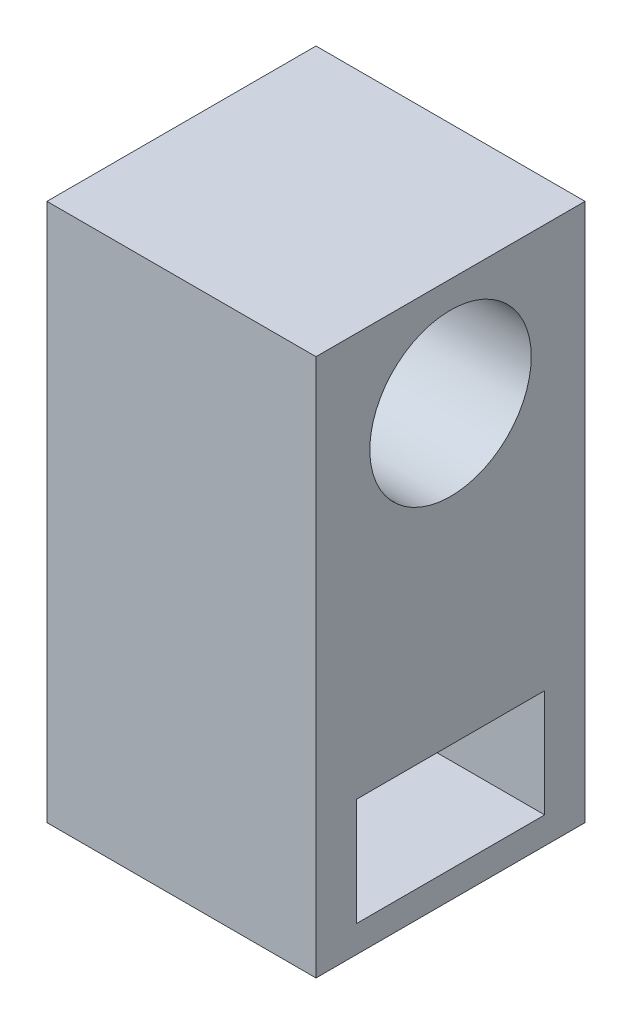
ISO-10303-21;
HEADER;
FILE_DESCRIPTION(('STEP AP214'),'2;1');
FILE_NAME('part.step','',(''),(''),'','','');
FILE_SCHEMA(('AUTOMOTIVE_DESIGN { 1 0 10303 214 1 1 1 1 }'));
ENDSEC;
DATA;
#1=APPLICATION_CONTEXT('core data for automotive mechanical design processes');
#2=APPLICATION_PROTOCOL_DEFINITION('international standard','automotive_design',2000,#1);
#3=PRODUCT_CONTEXT('',#1,'mechanical');
#4=PRODUCT('Part','Part','',(#3));
#5=PRODUCT_RELATED_PRODUCT_CATEGORY('part','',(#4));
#6=PRODUCT_DEFINITION_FORMATION('','',#4);
#7=PRODUCT_DEFINITION_CONTEXT('part definition',#1,'design');
#8=PRODUCT_DEFINITION('design','',#6,#7);
#9=PRODUCT_DEFINITION_SHAPE('','',#8);
#10=(LENGTH_UNIT() NAMED_UNIT(*) SI_UNIT(.MILLI.,.METRE.));
#11=(NAMED_UNIT(*) PLANE_ANGLE_UNIT() SI_UNIT($,.RADIAN.));
#12=(NAMED_UNIT(*) SI_UNIT($,.STERADIAN.) SOLID_ANGLE_UNIT());
#13=UNCERTAINTY_MEASURE_WITH_UNIT(LENGTH_MEASURE(1.E-05),#10,'distance_accuracy_value','');
#14=(GEOMETRIC_REPRESENTATION_CONTEXT(3) GLOBAL_UNCERTAINTY_ASSIGNED_CONTEXT((#13)) GLOBAL_UNIT_ASSIGNED_CONTEXT((#10,
#11,#12)) REPRESENTATION_CONTEXT('',''));
#15=CARTESIAN_POINT('',(0.,0.,0.));
#16=DIRECTION('',(0.,0.,1.));
#17=DIRECTION('',(1.,0.,0.));
#18=AXIS2_PLACEMENT_3D('',#15,#16,#17);
#19=CARTESIAN_POINT('',(41.2371134020619,70.1030927835051,100.));
#20=DIRECTION('',(0.,-1.,0.));
#21=DIRECTION('',(0.,0.,-1.));
#22=AXIS2_PLACEMENT_3D('',#19,#20,#21);
#23=PLANE('',#22);
#24=DIRECTION('',(-1.,0.,0.));
#25=VECTOR('',#24,1.);
#26=CARTESIAN_POINT('',(41.2371134020619,70.1030927835051,0.));
#27=LINE('',#26,#25);
#28=CARTESIAN_POINT('',(41.2371134020619,70.1030927835051,0.));
#29=VERTEX_POINT('',#28);
#30=CARTESIAN_POINT('',(-58.7628865979382,70.1030927835051,0.));
#31=VERTEX_POINT('',#30);
#32=EDGE_CURVE('E170',#29,#31,#27,.T.);
#33=ORIENTED_EDGE('',*,*,#32,.T.);
#34=DIRECTION('',(0.,0.,-1.));
#35=VECTOR('',#34,1.);
#36=CARTESIAN_POINT('',(-58.7628865979382,70.1030927835051,100.));
#37=LINE('',#36,#35);
#38=CARTESIAN_POINT('',(-58.7628865979382,70.1030927835051,100.));
#39=VERTEX_POINT('',#38);
#40=EDGE_CURVE('E11',#39,#31,#37,.T.);
#41=ORIENTED_EDGE('',*,*,#40,.F.);
#42=DIRECTION('',(-1.,0.,0.));
#43=VECTOR('',#42,1.);
#44=CARTESIAN_POINT('',(41.2371134020619,70.1030927835051,100.));
#45=LINE('',#44,#43);
#46=CARTESIAN_POINT('',(41.2371134020619,70.1030927835051,100.));
#47=VERTEX_POINT('',#46);
#48=EDGE_CURVE('E155',#47,#39,#45,.T.);
#49=ORIENTED_EDGE('',*,*,#48,.F.);
#50=DIRECTION('',(0.,0.,-1.));
#51=VECTOR('',#50,1.);
#52=CARTESIAN_POINT('',(41.2371134020619,70.1030927835051,100.));
#53=LINE('',#52,#51);
#54=EDGE_CURVE('E169',#47,#29,#53,.T.);
#55=ORIENTED_EDGE('',*,*,#54,.T.);
#56=EDGE_LOOP('',(#33,#41,#49,#55));
#57=FACE_BOUND('',#56,.T.);
#58=ADVANCED_FACE('F39',(#57),#23,.F.);
#59=CARTESIAN_POINT('',(-58.7628865979382,70.1030927835051,100.));
#60=DIRECTION('',(1.,0.,0.));
#61=DIRECTION('',(0.,1.,0.));
#62=AXIS2_PLACEMENT_3D('',#59,#60,#61);
#63=PLANE('',#62);
#64=CARTESIAN_POINT('',(-58.7628865979382,30.1030927835051,50.));
#65=DIRECTION('',(1.,0.,0.));
#66=DIRECTION('',(0.,0.,-1.));
#67=AXIS2_PLACEMENT_3D('',#64,#65,#66);
#68=CIRCLE('',#67,30.);
#69=CARTESIAN_POINT('',(-58.7628865979382,30.1030927835051,20.));
#70=VERTEX_POINT('',#69);
#71=EDGE_CURVE('E175',#70,#70,#68,.T.);
#72=ORIENTED_EDGE('',*,*,#71,.T.);
#73=EDGE_LOOP('',(#72));
#74=FACE_BOUND('',#73,.T.);
#75=DIRECTION('',(0.,1.,0.));
#76=VECTOR('',#75,1.);
#77=CARTESIAN_POINT('',(-58.7628865979382,-119.896907216495,15.));
#78=LINE('',#77,#76);
#79=CARTESIAN_POINT('',(-58.7628865979382,-119.896907216495,15.));
#80=VERTEX_POINT('',#79);
#81=CARTESIAN_POINT('',(-58.7628865979382,-79.8969072164949,15.));
#82=VERTEX_POINT('',#81);
#83=EDGE_CURVE('E113',#80,#82,#78,.T.);
#84=ORIENTED_EDGE('',*,*,#83,.T.);
#85=DIRECTION('',(0.,0.,1.));
#86=VECTOR('',#85,1.);
#87=CARTESIAN_POINT('',(-58.7628865979382,-79.8969072164949,15.));
#88=LINE('',#87,#86);
#89=CARTESIAN_POINT('',(-58.7628865979382,-79.8969072164949,85.));
#90=VERTEX_POINT('',#89);
#91=EDGE_CURVE('E106',#82,#90,#88,.T.);
#92=ORIENTED_EDGE('',*,*,#91,.T.);
#93=DIRECTION('',(0.,-1.,0.));
#94=VECTOR('',#93,1.);
#95=CARTESIAN_POINT('',(-58.7628865979382,-79.8969072164949,85.));
#96=LINE('',#95,#94);
#97=CARTESIAN_POINT('',(-58.7628865979381,-119.896907216495,85.));
#98=VERTEX_POINT('',#97);
#99=EDGE_CURVE('E116',#90,#98,#96,.T.);
#100=ORIENTED_EDGE('',*,*,#99,.T.);
#101=DIRECTION('',(0.,0.,-1.));
#102=VECTOR('',#101,1.);
#103=CARTESIAN_POINT('',(-58.7628865979382,-119.896907216495,85.));
#104=LINE('',#103,#102);
#105=EDGE_CURVE('E54',#98,#80,#104,.T.);
#106=ORIENTED_EDGE('',*,*,#105,.T.);
#107=EDGE_LOOP('',(#84,#92,#100,#106));
#108=FACE_BOUND('',#107,.T.);
#109=DIRECTION('',(0.,-1.,0.));
#110=VECTOR('',#109,1.);
#111=CARTESIAN_POINT('',(-58.7628865979382,70.1030927835051,0.));
#112=LINE('',#111,#110);
#113=CARTESIAN_POINT('',(-58.7628865979381,-129.896907216495,0.));
#114=VERTEX_POINT('',#113);
#115=EDGE_CURVE('E174',#31,#114,#112,.T.);
#116=ORIENTED_EDGE('',*,*,#115,.T.);
#117=DIRECTION('',(0.,0.,-1.));
#118=VECTOR('',#117,1.);
#119=CARTESIAN_POINT('',(-58.7628865979381,-129.896907216495,100.));
#120=LINE('',#119,#118);
#121=CARTESIAN_POINT('',(-58.7628865979381,-129.896907216495,100.));
#122=VERTEX_POINT('',#121);
#123=EDGE_CURVE('E47',#122,#114,#120,.T.);
#124=ORIENTED_EDGE('',*,*,#123,.F.);
#125=DIRECTION('',(0.,-1.,0.));
#126=VECTOR('',#125,1.);
#127=CARTESIAN_POINT('',(-58.7628865979382,70.1030927835051,100.));
#128=LINE('',#127,#126);
#129=EDGE_CURVE('E159',#39,#122,#128,.T.);
#130=ORIENTED_EDGE('',*,*,#129,.F.);
#131=ORIENTED_EDGE('',*,*,#40,.T.);
#132=EDGE_LOOP('',(#116,#124,#130,#131));
#133=FACE_BOUND('',#132,.T.);
#134=ADVANCED_FACE('F121',(#74,#108,#133),#63,.F.);
#135=CARTESIAN_POINT('',(-58.7628865979381,-129.896907216495,100.));
#136=DIRECTION('',(0.,1.,0.));
#137=DIRECTION('',(0.,0.,1.));
#138=AXIS2_PLACEMENT_3D('',#135,#136,#137);
#139=PLANE('',#138);
#140=DIRECTION('',(1.,0.,0.));
#141=VECTOR('',#140,1.);
#142=CARTESIAN_POINT('',(-58.7628865979381,-129.896907216495,0.));
#143=LINE('',#142,#141);
#144=CARTESIAN_POINT('',(41.2371134020619,-129.896907216495,0.));
#145=VERTEX_POINT('',#144);
#146=EDGE_CURVE('E178',#114,#145,#143,.T.);
#147=ORIENTED_EDGE('',*,*,#146,.T.);
#148=DIRECTION('',(0.,0.,-1.));
#149=VECTOR('',#148,1.);
#150=CARTESIAN_POINT('',(41.2371134020619,-129.896907216495,100.));
#151=LINE('',#150,#149);
#152=CARTESIAN_POINT('',(41.2371134020619,-129.896907216495,100.));
#153=VERTEX_POINT('',#152);
#154=EDGE_CURVE('E186',#153,#145,#151,.T.);
#155=ORIENTED_EDGE('',*,*,#154,.F.);
#156=DIRECTION('',(1.,0.,0.));
#157=VECTOR('',#156,1.);
#158=CARTESIAN_POINT('',(-58.7628865979381,-129.896907216495,100.));
#159=LINE('',#158,#157);
#160=EDGE_CURVE('E163',#122,#153,#159,.T.);
#161=ORIENTED_EDGE('',*,*,#160,.F.);
#162=ORIENTED_EDGE('',*,*,#123,.T.);
#163=EDGE_LOOP('',(#147,#155,#161,#162));
#164=FACE_BOUND('',#163,.T.);
#165=ADVANCED_FACE('F195',(#164),#139,.F.);
#166=CARTESIAN_POINT('',(41.2371134020619,-129.896907216495,100.));
#167=DIRECTION('',(-1.,0.,0.));
#168=DIRECTION('',(0.,0.,1.));
#169=AXIS2_PLACEMENT_3D('',#166,#167,#168);
#170=PLANE('',#169);
#171=CARTESIAN_POINT('',(41.2371134020619,30.1030927835051,50.));
#172=DIRECTION('',(1.,0.,0.));
#173=DIRECTION('',(0.,0.,-1.));
#174=AXIS2_PLACEMENT_3D('',#171,#172,#173);
#175=CIRCLE('',#174,30.);
#176=CARTESIAN_POINT('',(41.2371134020619,30.1030927835051,20.));
#177=VERTEX_POINT('',#176);
#178=EDGE_CURVE('E132',#177,#177,#175,.T.);
#179=ORIENTED_EDGE('',*,*,#178,.F.);
#180=EDGE_LOOP('',(#179));
#181=FACE_BOUND('',#180,.T.);
#182=DIRECTION('',(0.,-1.,0.));
#183=VECTOR('',#182,1.);
#184=CARTESIAN_POINT('',(41.2371134020619,-79.8969072164949,85.));
#185=LINE('',#184,#183);
#186=CARTESIAN_POINT('',(41.2371134020619,-79.8969072164949,85.));
#187=VERTEX_POINT('',#186);
#188=CARTESIAN_POINT('',(41.2371134020619,-119.896907216495,85.));
#189=VERTEX_POINT('',#188);
#190=EDGE_CURVE('E141',#187,#189,#185,.T.);
#191=ORIENTED_EDGE('',*,*,#190,.F.);
#192=DIRECTION('',(0.,0.,1.));
#193=VECTOR('',#192,1.);
#194=CARTESIAN_POINT('',(41.2371134020619,-79.8969072164949,15.));
#195=LINE('',#194,#193);
#196=CARTESIAN_POINT('',(41.2371134020619,-79.8969072164949,15.));
#197=VERTEX_POINT('',#196);
#198=EDGE_CURVE('E62',#197,#187,#195,.T.);
#199=ORIENTED_EDGE('',*,*,#198,.F.);
#200=DIRECTION('',(0.,1.,0.));
#201=VECTOR('',#200,1.);
#202=CARTESIAN_POINT('',(41.2371134020619,-119.896907216495,15.));
#203=LINE('',#202,#201);
#204=CARTESIAN_POINT('',(41.2371134020619,-119.896907216495,15.));
#205=VERTEX_POINT('',#204);
#206=EDGE_CURVE('E125',#205,#197,#203,.T.);
#207=ORIENTED_EDGE('',*,*,#206,.F.);
#208=DIRECTION('',(0.,0.,-1.));
#209=VECTOR('',#208,1.);
#210=CARTESIAN_POINT('',(41.2371134020619,-119.896907216495,85.));
#211=LINE('',#210,#209);
#212=EDGE_CURVE('E129',#189,#205,#211,.T.);
#213=ORIENTED_EDGE('',*,*,#212,.F.);
#214=EDGE_LOOP('',(#191,#199,#207,#213));
#215=FACE_BOUND('',#214,.T.);
#216=DIRECTION('',(0.,1.,0.));
#217=VECTOR('',#216,1.);
#218=CARTESIAN_POINT('',(41.2371134020619,-129.896907216495,0.));
#219=LINE('',#218,#217);
#220=EDGE_CURVE('E160',#145,#29,#219,.T.);
#221=ORIENTED_EDGE('',*,*,#220,.T.);
#222=ORIENTED_EDGE('',*,*,#54,.F.);
#223=DIRECTION('',(0.,1.,0.));
#224=VECTOR('',#223,1.);
#225=CARTESIAN_POINT('',(41.2371134020619,-129.896907216495,100.));
#226=LINE('',#225,#224);
#227=EDGE_CURVE('E166',#153,#47,#226,.T.);
#228=ORIENTED_EDGE('',*,*,#227,.F.);
#229=ORIENTED_EDGE('',*,*,#154,.T.);
#230=EDGE_LOOP('',(#221,#222,#228,#229));
#231=FACE_BOUND('',#230,.T.);
#232=ADVANCED_FACE('F203',(#181,#215,#231),#170,.F.);
#233=CARTESIAN_POINT('',(0.,0.,100.));
#234=DIRECTION('',(0.,0.,1.));
#235=DIRECTION('',(1.,0.,0.));
#236=AXIS2_PLACEMENT_3D('',#233,#234,#235);
#237=PLANE('',#236);
#238=ORIENTED_EDGE('',*,*,#48,.T.);
#239=ORIENTED_EDGE('',*,*,#129,.T.);
#240=ORIENTED_EDGE('',*,*,#160,.T.);
#241=ORIENTED_EDGE('',*,*,#227,.T.);
#242=EDGE_LOOP('',(#238,#239,#240,#241));
#243=FACE_BOUND('',#242,.T.);
#244=ADVANCED_FACE('F209',(#243),#237,.T.);
#245=CARTESIAN_POINT('',(0.,0.,0.));
#246=DIRECTION('',(0.,0.,1.));
#247=DIRECTION('',(1.,0.,0.));
#248=AXIS2_PLACEMENT_3D('',#245,#246,#247);
#249=PLANE('',#248);
#250=ORIENTED_EDGE('',*,*,#32,.F.);
#251=ORIENTED_EDGE('',*,*,#220,.F.);
#252=ORIENTED_EDGE('',*,*,#146,.F.);
#253=ORIENTED_EDGE('',*,*,#115,.F.);
#254=EDGE_LOOP('',(#250,#251,#252,#253));
#255=FACE_BOUND('',#254,.T.);
#256=ADVANCED_FACE('F200',(#255),#249,.F.);
#257=CARTESIAN_POINT('',(-58.7628865979382,-79.8969072164949,15.));
#258=DIRECTION('',(0.,1.,0.));
#259=DIRECTION('',(0.,0.,1.));
#260=AXIS2_PLACEMENT_3D('',#257,#258,#259);
#261=PLANE('',#260);
#262=ORIENTED_EDGE('',*,*,#198,.T.);
#263=DIRECTION('',(1.,0.,0.));
#264=VECTOR('',#263,1.);
#265=CARTESIAN_POINT('',(-58.7628865979382,-79.8969072164949,85.));
#266=LINE('',#265,#264);
#267=EDGE_CURVE('E102',#90,#187,#266,.T.);
#268=ORIENTED_EDGE('',*,*,#267,.F.);
#269=ORIENTED_EDGE('',*,*,#91,.F.);
#270=DIRECTION('',(1.,0.,0.));
#271=VECTOR('',#270,1.);
#272=CARTESIAN_POINT('',(-58.7628865979382,-79.8969072164949,15.));
#273=LINE('',#272,#271);
#274=EDGE_CURVE('E147',#82,#197,#273,.T.);
#275=ORIENTED_EDGE('',*,*,#274,.T.);
#276=EDGE_LOOP('',(#262,#268,#269,#275));
#277=FACE_BOUND('',#276,.T.);
#278=ADVANCED_FACE('F104',(#277),#261,.F.);
#279=CARTESIAN_POINT('',(-58.7628865979382,-119.896907216495,15.));
#280=DIRECTION('',(0.,0.,-1.));
#281=DIRECTION('',(-1.,0.,0.));
#282=AXIS2_PLACEMENT_3D('',#279,#280,#281);
#283=PLANE('',#282);
#284=ORIENTED_EDGE('',*,*,#206,.T.);
#285=ORIENTED_EDGE('',*,*,#274,.F.);
#286=ORIENTED_EDGE('',*,*,#83,.F.);
#287=DIRECTION('',(1.,0.,0.));
#288=VECTOR('',#287,1.);
#289=CARTESIAN_POINT('',(-58.7628865979382,-119.896907216495,15.));
#290=LINE('',#289,#288);
#291=EDGE_CURVE('E150',#80,#205,#290,.T.);
#292=ORIENTED_EDGE('',*,*,#291,.T.);
#293=EDGE_LOOP('',(#284,#285,#286,#292));
#294=FACE_BOUND('',#293,.T.);
#295=ADVANCED_FACE('F228',(#294),#283,.F.);
#296=CARTESIAN_POINT('',(-58.7628865979382,-119.896907216495,85.));
#297=DIRECTION('',(0.,-1.,0.));
#298=DIRECTION('',(0.,0.,-1.));
#299=AXIS2_PLACEMENT_3D('',#296,#297,#298);
#300=PLANE('',#299);
#301=ORIENTED_EDGE('',*,*,#212,.T.);
#302=ORIENTED_EDGE('',*,*,#291,.F.);
#303=ORIENTED_EDGE('',*,*,#105,.F.);
#304=DIRECTION('',(1.,0.,0.));
#305=VECTOR('',#304,1.);
#306=CARTESIAN_POINT('',(-58.7628865979382,-119.896907216495,85.));
#307=LINE('',#306,#305);
#308=EDGE_CURVE('E112',#98,#189,#307,.T.);
#309=ORIENTED_EDGE('',*,*,#308,.T.);
#310=EDGE_LOOP('',(#301,#302,#303,#309));
#311=FACE_BOUND('',#310,.T.);
#312=ADVANCED_FACE('F232',(#311),#300,.F.);
#313=CARTESIAN_POINT('',(-58.7628865979382,-79.8969072164949,85.));
#314=DIRECTION('',(0.,0.,1.));
#315=DIRECTION('',(1.,0.,0.));
#316=AXIS2_PLACEMENT_3D('',#313,#314,#315);
#317=PLANE('',#316);
#318=ORIENTED_EDGE('',*,*,#190,.T.);
#319=ORIENTED_EDGE('',*,*,#308,.F.);
#320=ORIENTED_EDGE('',*,*,#99,.F.);
#321=ORIENTED_EDGE('',*,*,#267,.T.);
#322=EDGE_LOOP('',(#318,#319,#320,#321));
#323=FACE_BOUND('',#322,.T.);
#324=ADVANCED_FACE('F117',(#323),#317,.F.);
#325=CARTESIAN_POINT('',(-58.7628865979382,30.1030927835051,50.));
#326=DIRECTION('',(1.,0.,0.));
#327=DIRECTION('',(0.,0.,-1.));
#328=AXIS2_PLACEMENT_3D('',#325,#326,#327);
#329=CYLINDRICAL_SURFACE('',#328,30.);
#330=ORIENTED_EDGE('',*,*,#71,.F.);
#331=EDGE_LOOP('',(#330));
#332=FACE_BOUND('',#331,.T.);
#333=ORIENTED_EDGE('',*,*,#178,.T.);
#334=EDGE_LOOP('',(#333));
#335=FACE_BOUND('',#334,.T.);
#336=ADVANCED_FACE('F231',(#332,#335),#329,.F.);
#337=CLOSED_SHELL('',(#58,#134,#165,#232,#244,#256,#278,#295,#312,#324,#336));
#338=MANIFOLD_SOLID_BREP('B2',#337);
#339=ADVANCED_BREP_SHAPE_REPRESENTATION('',(#18,#338),#14);
#340=SHAPE_DEFINITION_REPRESENTATION(#9,#339);
ENDSEC;
END-ISO-10303-21;
